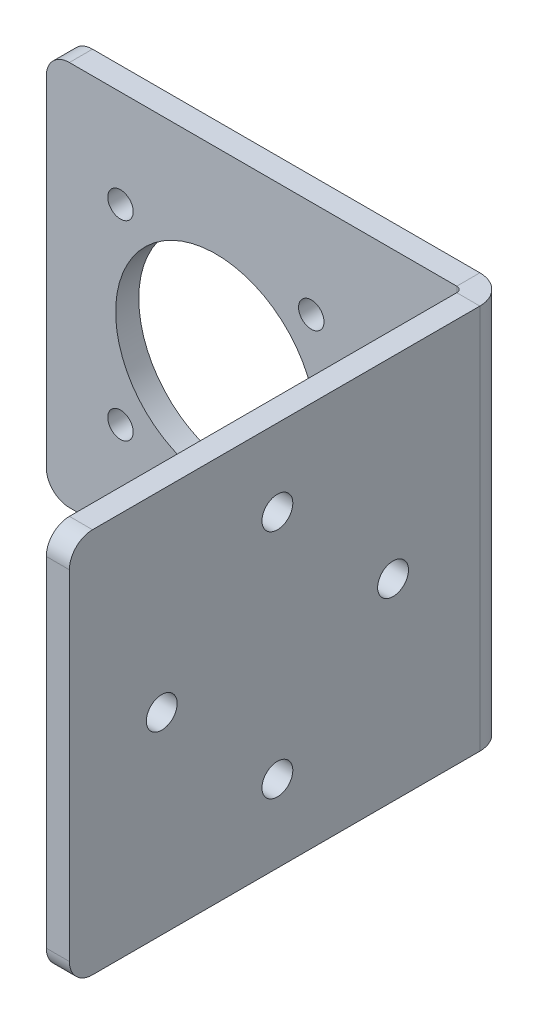
ISO-10303-21;
HEADER;
FILE_DESCRIPTION(('STEP AP214'),'2;1');
FILE_NAME('part.step','',(''),(''),'','','');
FILE_SCHEMA(('AUTOMOTIVE_DESIGN { 1 0 10303 214 1 1 1 1 }'));
ENDSEC;
DATA;
#1=APPLICATION_CONTEXT('core data for automotive mechanical design processes');
#2=APPLICATION_PROTOCOL_DEFINITION('international standard','automotive_design',2000,#1);
#3=PRODUCT_CONTEXT('',#1,'mechanical');
#4=PRODUCT('Part','Part','',(#3));
#5=PRODUCT_RELATED_PRODUCT_CATEGORY('part','',(#4));
#6=PRODUCT_DEFINITION_FORMATION('','',#4);
#7=PRODUCT_DEFINITION_CONTEXT('part definition',#1,'design');
#8=PRODUCT_DEFINITION('design','',#6,#7);
#9=PRODUCT_DEFINITION_SHAPE('','',#8);
#10=(LENGTH_UNIT() NAMED_UNIT(*) SI_UNIT(.MILLI.,.METRE.));
#11=(NAMED_UNIT(*) PLANE_ANGLE_UNIT() SI_UNIT($,.RADIAN.));
#12=(NAMED_UNIT(*) SI_UNIT($,.STERADIAN.) SOLID_ANGLE_UNIT());
#13=UNCERTAINTY_MEASURE_WITH_UNIT(LENGTH_MEASURE(1.E-05),#10,'distance_accuracy_value','');
#14=(GEOMETRIC_REPRESENTATION_CONTEXT(3) GLOBAL_UNCERTAINTY_ASSIGNED_CONTEXT((#13)) GLOBAL_UNIT_ASSIGNED_CONTEXT((#10,
#11,#12)) REPRESENTATION_CONTEXT('',''));
#15=CARTESIAN_POINT('',(0.,0.,0.));
#16=DIRECTION('',(0.,0.,1.));
#17=DIRECTION('',(1.,0.,0.));
#18=AXIS2_PLACEMENT_3D('',#15,#16,#17);
#19=CARTESIAN_POINT('',(-1.02002153225473,0.,-1.02002153225474));
#20=DIRECTION('',(1.,0.,0.));
#21=DIRECTION('',(0.,0.,-1.));
#22=AXIS2_PLACEMENT_3D('',#19,#20,#21);
#23=PLANE('',#22);
#24=CARTESIAN_POINT('',(-1.02002153225477,0.,12.0000000000002));
#25=DIRECTION('',(-1.,0.,0.));
#26=DIRECTION('',(0.,0.,1.));
#27=AXIS2_PLACEMENT_3D('',#24,#25,#26);
#28=CIRCLE('',#27,2.);
#29=CARTESIAN_POINT('',(-1.02002153225478,0.,14.0000000000002));
#30=VERTEX_POINT('',#29);
#31=EDGE_CURVE('E200',#30,#30,#28,.T.);
#32=ORIENTED_EDGE('',*,*,#31,.F.);
#33=EDGE_LOOP('',(#32));
#34=FACE_BOUND('',#33,.T.);
#35=CARTESIAN_POINT('',(-1.02002153225488,0.,42.0000000000002));
#36=DIRECTION('',(-1.,0.,0.));
#37=DIRECTION('',(0.,0.,1.));
#38=AXIS2_PLACEMENT_3D('',#35,#36,#37);
#39=CIRCLE('',#38,2.);
#40=CARTESIAN_POINT('',(-1.02002153225488,0.,44.0000000000002));
#41=VERTEX_POINT('',#40);
#42=EDGE_CURVE('E276',#41,#41,#39,.T.);
#43=ORIENTED_EDGE('',*,*,#42,.F.);
#44=EDGE_LOOP('',(#43));
#45=FACE_BOUND('',#44,.T.);
#46=CARTESIAN_POINT('',(-1.02002153225483,15.,27.0000000000002));
#47=DIRECTION('',(-1.,0.,0.));
#48=DIRECTION('',(0.,0.,1.));
#49=AXIS2_PLACEMENT_3D('',#46,#47,#48);
#50=CIRCLE('',#49,2.);
#51=CARTESIAN_POINT('',(-1.02002153225483,15.,29.0000000000002));
#52=VERTEX_POINT('',#51);
#53=EDGE_CURVE('E272',#52,#52,#50,.T.);
#54=ORIENTED_EDGE('',*,*,#53,.F.);
#55=EDGE_LOOP('',(#54));
#56=FACE_BOUND('',#55,.T.);
#57=CARTESIAN_POINT('',(-1.02002153225483,-15.,27.0000000000002));
#58=DIRECTION('',(-1.,0.,0.));
#59=DIRECTION('',(0.,0.,1.));
#60=AXIS2_PLACEMENT_3D('',#57,#58,#59);
#61=CIRCLE('',#60,2.);
#62=CARTESIAN_POINT('',(-1.02002153225483,-15.,29.0000000000002));
#63=VERTEX_POINT('',#62);
#64=EDGE_CURVE('E269',#63,#63,#61,.T.);
#65=ORIENTED_EDGE('',*,*,#64,.F.);
#66=EDGE_LOOP('',(#65));
#67=FACE_BOUND('',#66,.T.);
#68=DIRECTION('',(0.,0.,1.));
#69=VECTOR('',#68,1.);
#70=CARTESIAN_POINT('',(-1.02002153225454,-25.,-56.0200215322547));
#71=LINE('',#70,#69);
#72=CARTESIAN_POINT('',(-1.02002153225473,-25.,0.736600000000003));
#73=VERTEX_POINT('',#72);
#74=CARTESIAN_POINT('',(-1.02002153225491,-25.,50.9799784677453));
#75=VERTEX_POINT('',#74);
#76=EDGE_CURVE('E174',#73,#75,#71,.T.);
#77=ORIENTED_EDGE('',*,*,#76,.T.);
#78=CARTESIAN_POINT('',(-1.02002153225491,-22.,50.9799784677453));
#79=DIRECTION('',(1.,0.,0.));
#80=DIRECTION('',(0.,0.,-1.));
#81=AXIS2_PLACEMENT_3D('',#78,#79,#80);
#82=CIRCLE('',#81,3.);
#83=CARTESIAN_POINT('',(-1.02002153225492,-22.,53.9799784677453));
#84=VERTEX_POINT('',#83);
#85=EDGE_CURVE('E214',#75,#84,#82,.F.);
#86=ORIENTED_EDGE('',*,*,#85,.T.);
#87=DIRECTION('',(0.,1.,0.));
#88=VECTOR('',#87,1.);
#89=CARTESIAN_POINT('',(-1.02002153225492,-25.,53.9799784677453));
#90=LINE('',#89,#88);
#91=CARTESIAN_POINT('',(-1.02002153225492,22.,53.9799784677453));
#92=VERTEX_POINT('',#91);
#93=EDGE_CURVE('E175',#84,#92,#90,.T.);
#94=ORIENTED_EDGE('',*,*,#93,.T.);
#95=CARTESIAN_POINT('',(-1.02002153225491,22.,50.9799784677453));
#96=DIRECTION('',(1.,0.,0.));
#97=DIRECTION('',(0.,0.,-1.));
#98=AXIS2_PLACEMENT_3D('',#95,#96,#97);
#99=CIRCLE('',#98,3.);
#100=CARTESIAN_POINT('',(-1.02002153225491,25.,50.9799784677453));
#101=VERTEX_POINT('',#100);
#102=EDGE_CURVE('E212',#92,#101,#99,.F.);
#103=ORIENTED_EDGE('',*,*,#102,.T.);
#104=DIRECTION('',(0.,0.,-1.));
#105=VECTOR('',#104,1.);
#106=CARTESIAN_POINT('',(-1.02002153225454,25.,-56.0200215322547));
#107=LINE('',#106,#105);
#108=CARTESIAN_POINT('',(-1.02002153225473,25.,0.736600000000003));
#109=VERTEX_POINT('',#108);
#110=EDGE_CURVE('E178',#101,#109,#107,.T.);
#111=ORIENTED_EDGE('',*,*,#110,.T.);
#112=DIRECTION('',(0.,-1.,0.));
#113=VECTOR('',#112,1.);
#114=CARTESIAN_POINT('',(-1.02002153225473,0.,0.7366));
#115=LINE('',#114,#113);
#116=EDGE_CURVE('E183',#109,#73,#115,.T.);
#117=ORIENTED_EDGE('',*,*,#116,.T.);
#118=EDGE_LOOP('',(#77,#86,#94,#103,#111,#117));
#119=FACE_BOUND('',#118,.T.);
#120=ADVANCED_FACE('F44',(#34,#45,#56,#67,#119),#23,.F.);
#121=CARTESIAN_POINT('',(1.97997846774508,-25.,53.9799784677453));
#122=DIRECTION('',(0.,0.,1.));
#123=DIRECTION('',(1.,0.,0.));
#124=AXIS2_PLACEMENT_3D('',#121,#122,#123);
#125=PLANE('',#124);
#126=ORIENTED_EDGE('',*,*,#93,.F.);
#127=DIRECTION('',(-1.,0.,0.));
#128=VECTOR('',#127,1.);
#129=CARTESIAN_POINT('',(1.97997846774508,-22.,53.9799784677453));
#130=LINE('',#129,#128);
#131=CARTESIAN_POINT('',(1.97997846774508,-22.,53.9799784677453));
#132=VERTEX_POINT('',#131);
#133=EDGE_CURVE('E219',#84,#132,#130,.F.);
#134=ORIENTED_EDGE('',*,*,#133,.T.);
#135=DIRECTION('',(0.,1.,0.));
#136=VECTOR('',#135,1.);
#137=CARTESIAN_POINT('',(1.97997846774508,-25.,53.9799784677453));
#138=LINE('',#137,#136);
#139=CARTESIAN_POINT('',(1.97997846774508,22.,53.9799784677453));
#140=VERTEX_POINT('',#139);
#141=EDGE_CURVE('E170',#132,#140,#138,.T.);
#142=ORIENTED_EDGE('',*,*,#141,.T.);
#143=DIRECTION('',(-1.,0.,0.));
#144=VECTOR('',#143,1.);
#145=CARTESIAN_POINT('',(1.97997846774508,22.,53.9799784677453));
#146=LINE('',#145,#144);
#147=EDGE_CURVE('E216',#140,#92,#146,.T.);
#148=ORIENTED_EDGE('',*,*,#147,.T.);
#149=EDGE_LOOP('',(#126,#134,#142,#148));
#150=FACE_BOUND('',#149,.T.);
#151=ADVANCED_FACE('F335',(#150),#125,.T.);
#152=CARTESIAN_POINT('',(1.97997846774546,-25.,-56.0200215322547));
#153=DIRECTION('',(0.,-1.,0.));
#154=DIRECTION('',(1.,0.,0.));
#155=AXIS2_PLACEMENT_3D('',#152,#153,#154);
#156=PLANE('',#155);
#157=DIRECTION('',(0.,0.,1.));
#158=VECTOR('',#157,1.);
#159=CARTESIAN_POINT('',(1.97997846774546,-25.,-56.0200215322547));
#160=LINE('',#159,#158);
#161=CARTESIAN_POINT('',(1.97997846774526,-25.,0.736600000000023));
#162=VERTEX_POINT('',#161);
#163=CARTESIAN_POINT('',(1.97997846774509,-25.,50.9799784677453));
#164=VERTEX_POINT('',#163);
#165=EDGE_CURVE('E181',#162,#164,#160,.T.);
#166=ORIENTED_EDGE('',*,*,#165,.T.);
#167=DIRECTION('',(-1.,0.,0.));
#168=VECTOR('',#167,1.);
#169=CARTESIAN_POINT('',(1.97997846774509,-25.,50.9799784677453));
#170=LINE('',#169,#168);
#171=EDGE_CURVE('E189',#164,#75,#170,.T.);
#172=ORIENTED_EDGE('',*,*,#171,.T.);
#173=ORIENTED_EDGE('',*,*,#76,.F.);
#174=DIRECTION('',(-1.,0.,0.));
#175=VECTOR('',#174,1.);
#176=CARTESIAN_POINT('',(1.97997846774527,-25.,0.736600000000013));
#177=LINE('',#176,#175);
#178=EDGE_CURVE('E180',#162,#73,#177,.T.);
#179=ORIENTED_EDGE('',*,*,#178,.F.);
#180=EDGE_LOOP('',(#166,#172,#173,#179));
#181=FACE_BOUND('',#180,.T.);
#182=ADVANCED_FACE('F341',(#181),#156,.T.);
#183=CARTESIAN_POINT('',(1.97997846774546,25.,-56.0200215322547));
#184=DIRECTION('',(0.,1.,0.));
#185=DIRECTION('',(-1.,0.,0.));
#186=AXIS2_PLACEMENT_3D('',#183,#184,#185);
#187=PLANE('',#186);
#188=ORIENTED_EDGE('',*,*,#110,.F.);
#189=DIRECTION('',(-1.,0.,0.));
#190=VECTOR('',#189,1.);
#191=CARTESIAN_POINT('',(1.97997846774509,25.,50.9799784677453));
#192=LINE('',#191,#190);
#193=CARTESIAN_POINT('',(1.97997846774509,25.,50.9799784677453));
#194=VERTEX_POINT('',#193);
#195=EDGE_CURVE('E225',#101,#194,#192,.F.);
#196=ORIENTED_EDGE('',*,*,#195,.T.);
#197=DIRECTION('',(0.,0.,-1.));
#198=VECTOR('',#197,1.);
#199=CARTESIAN_POINT('',(1.97997846774546,25.,-56.0200215322547));
#200=LINE('',#199,#198);
#201=CARTESIAN_POINT('',(1.97997846774527,25.,0.736600000000013));
#202=VERTEX_POINT('',#201);
#203=EDGE_CURVE('E173',#194,#202,#200,.T.);
#204=ORIENTED_EDGE('',*,*,#203,.T.);
#205=DIRECTION('',(1.,0.,0.));
#206=VECTOR('',#205,1.);
#207=CARTESIAN_POINT('',(1.97997846774527,25.,0.736600000000013));
#208=LINE('',#207,#206);
#209=EDGE_CURVE('E186',#109,#202,#208,.T.);
#210=ORIENTED_EDGE('',*,*,#209,.F.);
#211=EDGE_LOOP('',(#188,#196,#204,#210));
#212=FACE_BOUND('',#211,.T.);
#213=ADVANCED_FACE('F349',(#212),#187,.T.);
#214=CARTESIAN_POINT('',(1.97997846774527,0.,-1.02002153225473));
#215=DIRECTION('',(1.,0.,0.));
#216=DIRECTION('',(0.,0.,-1.));
#217=AXIS2_PLACEMENT_3D('',#214,#215,#216);
#218=PLANE('',#217);
#219=CARTESIAN_POINT('',(1.97997846774523,0.,12.0000000000002));
#220=DIRECTION('',(1.,0.,0.));
#221=DIRECTION('',(0.,0.,-1.));
#222=AXIS2_PLACEMENT_3D('',#219,#220,#221);
#223=CIRCLE('',#222,2.);
#224=CARTESIAN_POINT('',(1.97997846774523,0.,10.0000000000002));
#225=VERTEX_POINT('',#224);
#226=EDGE_CURVE('E206',#225,#225,#223,.T.);
#227=ORIENTED_EDGE('',*,*,#226,.F.);
#228=EDGE_LOOP('',(#227));
#229=FACE_BOUND('',#228,.T.);
#230=CARTESIAN_POINT('',(1.97997846774512,0.,42.0000000000002));
#231=DIRECTION('',(1.,0.,0.));
#232=DIRECTION('',(0.,0.,-1.));
#233=AXIS2_PLACEMENT_3D('',#230,#231,#232);
#234=CIRCLE('',#233,2.);
#235=CARTESIAN_POINT('',(1.97997846774513,0.,40.0000000000002));
#236=VERTEX_POINT('',#235);
#237=EDGE_CURVE('E203',#236,#236,#234,.T.);
#238=ORIENTED_EDGE('',*,*,#237,.F.);
#239=EDGE_LOOP('',(#238));
#240=FACE_BOUND('',#239,.T.);
#241=CARTESIAN_POINT('',(1.97997846774517,15.,27.0000000000002));
#242=DIRECTION('',(1.,0.,0.));
#243=DIRECTION('',(0.,0.,-1.));
#244=AXIS2_PLACEMENT_3D('',#241,#242,#243);
#245=CIRCLE('',#244,2.);
#246=CARTESIAN_POINT('',(1.97997846774518,15.,25.0000000000002));
#247=VERTEX_POINT('',#246);
#248=EDGE_CURVE('E199',#247,#247,#245,.T.);
#249=ORIENTED_EDGE('',*,*,#248,.F.);
#250=EDGE_LOOP('',(#249));
#251=FACE_BOUND('',#250,.T.);
#252=CARTESIAN_POINT('',(1.97997846774517,-15.,27.0000000000002));
#253=DIRECTION('',(1.,0.,0.));
#254=DIRECTION('',(0.,0.,-1.));
#255=AXIS2_PLACEMENT_3D('',#252,#253,#254);
#256=CIRCLE('',#255,2.);
#257=CARTESIAN_POINT('',(1.97997846774518,-15.,25.0000000000002));
#258=VERTEX_POINT('',#257);
#259=EDGE_CURVE('E196',#258,#258,#256,.T.);
#260=ORIENTED_EDGE('',*,*,#259,.F.);
#261=EDGE_LOOP('',(#260));
#262=FACE_BOUND('',#261,.T.);
#263=ORIENTED_EDGE('',*,*,#141,.F.);
#264=CARTESIAN_POINT('',(1.97997846774509,-22.,50.9799784677453));
#265=DIRECTION('',(1.,0.,0.));
#266=DIRECTION('',(0.,0.,-1.));
#267=AXIS2_PLACEMENT_3D('',#264,#265,#266);
#268=CIRCLE('',#267,3.);
#269=EDGE_CURVE('E223',#132,#164,#268,.T.);
#270=ORIENTED_EDGE('',*,*,#269,.T.);
#271=ORIENTED_EDGE('',*,*,#165,.F.);
#272=DIRECTION('',(0.,-1.,0.));
#273=VECTOR('',#272,1.);
#274=CARTESIAN_POINT('',(1.97997846774527,0.,0.73660000000001));
#275=LINE('',#274,#273);
#276=EDGE_CURVE('E156',#202,#162,#275,.T.);
#277=ORIENTED_EDGE('',*,*,#276,.F.);
#278=ORIENTED_EDGE('',*,*,#203,.F.);
#279=CARTESIAN_POINT('',(1.97997846774509,22.,50.9799784677453));
#280=DIRECTION('',(1.,0.,0.));
#281=DIRECTION('',(0.,0.,-1.));
#282=AXIS2_PLACEMENT_3D('',#279,#280,#281);
#283=CIRCLE('',#282,3.);
#284=EDGE_CURVE('E221',#194,#140,#283,.T.);
#285=ORIENTED_EDGE('',*,*,#284,.T.);
#286=EDGE_LOOP('',(#263,#270,#271,#277,#278,#285));
#287=FACE_BOUND('',#286,.T.);
#288=ADVANCED_FACE('F352',(#229,#240,#251,#262,#287),#218,.T.);
#289=CARTESIAN_POINT('',(-55.,-25.,-3.));
#290=DIRECTION('',(-1.,0.,0.));
#291=DIRECTION('',(0.,0.,1.));
#292=AXIS2_PLACEMENT_3D('',#289,#290,#291);
#293=PLANE('',#292);
#294=DIRECTION('',(0.,-1.,0.));
#295=VECTOR('',#294,1.);
#296=CARTESIAN_POINT('',(-55.,-25.,0.));
#297=LINE('',#296,#295);
#298=CARTESIAN_POINT('',(-55.,22.,0.));
#299=VERTEX_POINT('',#298);
#300=CARTESIAN_POINT('',(-55.,-22.,0.));
#301=VERTEX_POINT('',#300);
#302=EDGE_CURVE('E254',#299,#301,#297,.T.);
#303=ORIENTED_EDGE('',*,*,#302,.F.);
#304=DIRECTION('',(0.,0.,1.));
#305=VECTOR('',#304,1.);
#306=CARTESIAN_POINT('',(-55.,22.,-3.));
#307=LINE('',#306,#305);
#308=CARTESIAN_POINT('',(-55.,22.,-3.));
#309=VERTEX_POINT('',#308);
#310=EDGE_CURVE('E237',#299,#309,#307,.F.);
#311=ORIENTED_EDGE('',*,*,#310,.T.);
#312=DIRECTION('',(0.,-1.,0.));
#313=VECTOR('',#312,1.);
#314=CARTESIAN_POINT('',(-55.,-25.,-3.));
#315=LINE('',#314,#313);
#316=CARTESIAN_POINT('',(-55.,-22.,-3.));
#317=VERTEX_POINT('',#316);
#318=EDGE_CURVE('E165',#309,#317,#315,.T.);
#319=ORIENTED_EDGE('',*,*,#318,.T.);
#320=DIRECTION('',(0.,0.,1.));
#321=VECTOR('',#320,1.);
#322=CARTESIAN_POINT('',(-55.,-22.,-3.));
#323=LINE('',#322,#321);
#324=EDGE_CURVE('E234',#317,#301,#323,.T.);
#325=ORIENTED_EDGE('',*,*,#324,.T.);
#326=EDGE_LOOP('',(#303,#311,#319,#325));
#327=FACE_BOUND('',#326,.T.);
#328=ADVANCED_FACE('F257',(#327),#293,.T.);
#329=CARTESIAN_POINT('',(0.,0.,-3.));
#330=DIRECTION('',(0.,0.,-1.));
#331=DIRECTION('',(-1.,0.,0.));
#332=AXIS2_PLACEMENT_3D('',#329,#330,#331);
#333=PLANE('',#332);
#334=CARTESIAN_POINT('',(-45.3743686707647,12.3743686707645,-3.));
#335=DIRECTION('',(0.,0.,1.));
#336=DIRECTION('',(1.,0.,0.));
#337=AXIS2_PLACEMENT_3D('',#334,#335,#336);
#338=CIRCLE('',#337,1.65);
#339=CARTESIAN_POINT('',(-43.7243686707646,12.3743686707645,-3.));
#340=VERTEX_POINT('',#339);
#341=EDGE_CURVE('E293',#340,#340,#338,.T.);
#342=ORIENTED_EDGE('',*,*,#341,.T.);
#343=EDGE_LOOP('',(#342));
#344=FACE_BOUND('',#343,.T.);
#345=CARTESIAN_POINT('',(-45.374368670764,-12.3743686707645,-3.));
#346=DIRECTION('',(0.,0.,1.));
#347=DIRECTION('',(1.,0.,0.));
#348=AXIS2_PLACEMENT_3D('',#345,#346,#347);
#349=CIRCLE('',#348,1.65);
#350=CARTESIAN_POINT('',(-43.724368670764,-12.3743686707645,-3.));
#351=VERTEX_POINT('',#350);
#352=EDGE_CURVE('E299',#351,#351,#349,.T.);
#353=ORIENTED_EDGE('',*,*,#352,.T.);
#354=EDGE_LOOP('',(#353));
#355=FACE_BOUND('',#354,.T.);
#356=CARTESIAN_POINT('',(-20.6256313292348,-12.3743686707639,-3.));
#357=DIRECTION('',(0.,0.,1.));
#358=DIRECTION('',(1.,0.,0.));
#359=AXIS2_PLACEMENT_3D('',#356,#357,#358);
#360=CIRCLE('',#359,1.65000000000001);
#361=CARTESIAN_POINT('',(-18.9756313292348,-12.3743686707639,-3.));
#362=VERTEX_POINT('',#361);
#363=EDGE_CURVE('E305',#362,#362,#360,.T.);
#364=ORIENTED_EDGE('',*,*,#363,.T.);
#365=EDGE_LOOP('',(#364));
#366=FACE_BOUND('',#365,.T.);
#367=CARTESIAN_POINT('',(-20.6256313292354,12.3743686707653,-3.));
#368=DIRECTION('',(0.,0.,1.));
#369=DIRECTION('',(1.,0.,0.));
#370=AXIS2_PLACEMENT_3D('',#367,#368,#369);
#371=CIRCLE('',#370,1.65);
#372=CARTESIAN_POINT('',(-18.9756313292354,12.3743686707653,-3.));
#373=VERTEX_POINT('',#372);
#374=EDGE_CURVE('E286',#373,#373,#371,.T.);
#375=ORIENTED_EDGE('',*,*,#374,.T.);
#376=EDGE_LOOP('',(#375));
#377=FACE_BOUND('',#376,.T.);
#378=CARTESIAN_POINT('',(-33.,0.,-3.));
#379=DIRECTION('',(0.,0.,-1.));
#380=DIRECTION('',(-1.,0.,0.));
#381=AXIS2_PLACEMENT_3D('',#378,#379,#380);
#382=CIRCLE('',#381,13.);
#383=CARTESIAN_POINT('',(-46.,0.,-3.));
#384=VERTEX_POINT('',#383);
#385=EDGE_CURVE('E273',#384,#384,#382,.T.);
#386=ORIENTED_EDGE('',*,*,#385,.F.);
#387=EDGE_LOOP('',(#386));
#388=FACE_BOUND('',#387,.T.);
#389=ORIENTED_EDGE('',*,*,#318,.F.);
#390=CARTESIAN_POINT('',(-52.,22.,-3.));
#391=DIRECTION('',(0.,0.,-1.));
#392=DIRECTION('',(-1.,0.,0.));
#393=AXIS2_PLACEMENT_3D('',#390,#391,#392);
#394=CIRCLE('',#393,3.);
#395=CARTESIAN_POINT('',(-52.,25.,-3.));
#396=VERTEX_POINT('',#395);
#397=EDGE_CURVE('E52',#309,#396,#394,.T.);
#398=ORIENTED_EDGE('',*,*,#397,.T.);
#399=DIRECTION('',(-1.,0.,0.));
#400=VECTOR('',#399,1.);
#401=CARTESIAN_POINT('',(-55.,25.,-3.));
#402=LINE('',#401,#400);
#403=CARTESIAN_POINT('',(-1.75662153225474,25.,-3.));
#404=VERTEX_POINT('',#403);
#405=EDGE_CURVE('E163',#404,#396,#402,.T.);
#406=ORIENTED_EDGE('',*,*,#405,.F.);
#407=DIRECTION('',(0.,-1.,0.));
#408=VECTOR('',#407,1.);
#409=CARTESIAN_POINT('',(-1.75662153225474,0.,-3.));
#410=LINE('',#409,#408);
#411=CARTESIAN_POINT('',(-1.75662153225474,-25.,-3.));
#412=VERTEX_POINT('',#411);
#413=EDGE_CURVE('E136',#404,#412,#410,.T.);
#414=ORIENTED_EDGE('',*,*,#413,.T.);
#415=DIRECTION('',(1.,0.,0.));
#416=VECTOR('',#415,1.);
#417=CARTESIAN_POINT('',(-55.,-25.,-3.));
#418=LINE('',#417,#416);
#419=CARTESIAN_POINT('',(-52.,-25.,-3.));
#420=VERTEX_POINT('',#419);
#421=EDGE_CURVE('E131',#420,#412,#418,.T.);
#422=ORIENTED_EDGE('',*,*,#421,.F.);
#423=CARTESIAN_POINT('',(-52.,-22.,-3.));
#424=DIRECTION('',(0.,0.,-1.));
#425=DIRECTION('',(-1.,0.,0.));
#426=AXIS2_PLACEMENT_3D('',#423,#424,#425);
#427=CIRCLE('',#426,3.);
#428=EDGE_CURVE('E64',#420,#317,#427,.T.);
#429=ORIENTED_EDGE('',*,*,#428,.T.);
#430=EDGE_LOOP('',(#389,#398,#406,#414,#422,#429));
#431=FACE_BOUND('',#430,.T.);
#432=ADVANCED_FACE('F161',(#344,#355,#366,#377,#388,#431),#333,.T.);
#433=CARTESIAN_POINT('',(-55.,-25.,-3.));
#434=DIRECTION('',(0.,-1.,0.));
#435=DIRECTION('',(0.,0.,-1.));
#436=AXIS2_PLACEMENT_3D('',#433,#434,#435);
#437=PLANE('',#436);
#438=DIRECTION('',(1.,0.,0.));
#439=VECTOR('',#438,1.);
#440=CARTESIAN_POINT('',(-55.,-25.,0.));
#441=LINE('',#440,#439);
#442=CARTESIAN_POINT('',(-52.,-25.,0.));
#443=VERTEX_POINT('',#442);
#444=CARTESIAN_POINT('',(-1.75662153225474,-25.,0.));
#445=VERTEX_POINT('',#444);
#446=EDGE_CURVE('E259',#443,#445,#441,.T.);
#447=ORIENTED_EDGE('',*,*,#446,.F.);
#448=DIRECTION('',(0.,0.,1.));
#449=VECTOR('',#448,1.);
#450=CARTESIAN_POINT('',(-52.,-25.,-3.));
#451=LINE('',#450,#449);
#452=EDGE_CURVE('E12',#443,#420,#451,.F.);
#453=ORIENTED_EDGE('',*,*,#452,.T.);
#454=ORIENTED_EDGE('',*,*,#421,.T.);
#455=DIRECTION('',(0.,0.,1.));
#456=VECTOR('',#455,1.);
#457=CARTESIAN_POINT('',(-1.75662153225474,-25.,-3.));
#458=LINE('',#457,#456);
#459=EDGE_CURVE('E134',#412,#445,#458,.T.);
#460=ORIENTED_EDGE('',*,*,#459,.T.);
#461=EDGE_LOOP('',(#447,#453,#454,#460));
#462=FACE_BOUND('',#461,.T.);
#463=ADVANCED_FACE('F133',(#462),#437,.T.);
#464=CARTESIAN_POINT('',(0.,0.,0.));
#465=DIRECTION('',(0.,0.,-1.));
#466=DIRECTION('',(-1.,0.,0.));
#467=AXIS2_PLACEMENT_3D('',#464,#465,#466);
#468=PLANE('',#467);
#469=CARTESIAN_POINT('',(-45.3743686707647,12.3743686707645,0.));
#470=DIRECTION('',(0.,0.,1.));
#471=DIRECTION('',(1.,0.,0.));
#472=AXIS2_PLACEMENT_3D('',#469,#470,#471);
#473=CIRCLE('',#472,1.65);
#474=CARTESIAN_POINT('',(-43.7243686707646,12.3743686707645,0.));
#475=VERTEX_POINT('',#474);
#476=EDGE_CURVE('E296',#475,#475,#473,.T.);
#477=ORIENTED_EDGE('',*,*,#476,.F.);
#478=EDGE_LOOP('',(#477));
#479=FACE_BOUND('',#478,.T.);
#480=CARTESIAN_POINT('',(-45.374368670764,-12.3743686707645,0.));
#481=DIRECTION('',(0.,0.,1.));
#482=DIRECTION('',(1.,0.,0.));
#483=AXIS2_PLACEMENT_3D('',#480,#481,#482);
#484=CIRCLE('',#483,1.65);
#485=CARTESIAN_POINT('',(-43.724368670764,-12.3743686707645,0.));
#486=VERTEX_POINT('',#485);
#487=EDGE_CURVE('E302',#486,#486,#484,.T.);
#488=ORIENTED_EDGE('',*,*,#487,.F.);
#489=EDGE_LOOP('',(#488));
#490=FACE_BOUND('',#489,.T.);
#491=CARTESIAN_POINT('',(-20.6256313292348,-12.3743686707639,0.));
#492=DIRECTION('',(0.,0.,1.));
#493=DIRECTION('',(1.,0.,0.));
#494=AXIS2_PLACEMENT_3D('',#491,#492,#493);
#495=CIRCLE('',#494,1.65000000000001);
#496=CARTESIAN_POINT('',(-18.9756313292348,-12.3743686707639,0.));
#497=VERTEX_POINT('',#496);
#498=EDGE_CURVE('E290',#497,#497,#495,.T.);
#499=ORIENTED_EDGE('',*,*,#498,.F.);
#500=EDGE_LOOP('',(#499));
#501=FACE_BOUND('',#500,.T.);
#502=CARTESIAN_POINT('',(-20.6256313292354,12.3743686707653,0.));
#503=DIRECTION('',(0.,0.,1.));
#504=DIRECTION('',(1.,0.,0.));
#505=AXIS2_PLACEMENT_3D('',#502,#503,#504);
#506=CIRCLE('',#505,1.65);
#507=CARTESIAN_POINT('',(-18.9756313292354,12.3743686707653,0.));
#508=VERTEX_POINT('',#507);
#509=EDGE_CURVE('E287',#508,#508,#506,.T.);
#510=ORIENTED_EDGE('',*,*,#509,.F.);
#511=EDGE_LOOP('',(#510));
#512=FACE_BOUND('',#511,.T.);
#513=CARTESIAN_POINT('',(-33.,0.,0.));
#514=DIRECTION('',(0.,0.,1.));
#515=DIRECTION('',(1.,0.,0.));
#516=AXIS2_PLACEMENT_3D('',#513,#514,#515);
#517=CIRCLE('',#516,13.);
#518=CARTESIAN_POINT('',(-20.,0.,0.));
#519=VERTEX_POINT('',#518);
#520=EDGE_CURVE('E283',#519,#519,#517,.T.);
#521=ORIENTED_EDGE('',*,*,#520,.F.);
#522=EDGE_LOOP('',(#521));
#523=FACE_BOUND('',#522,.T.);
#524=DIRECTION('',(-1.,0.,0.));
#525=VECTOR('',#524,1.);
#526=CARTESIAN_POINT('',(-55.,25.,0.));
#527=LINE('',#526,#525);
#528=CARTESIAN_POINT('',(-1.75662153225474,25.,0.));
#529=VERTEX_POINT('',#528);
#530=CARTESIAN_POINT('',(-52.,25.,0.));
#531=VERTEX_POINT('',#530);
#532=EDGE_CURVE('E148',#529,#531,#527,.T.);
#533=ORIENTED_EDGE('',*,*,#532,.T.);
#534=CARTESIAN_POINT('',(-52.,22.,0.));
#535=DIRECTION('',(0.,0.,-1.));
#536=DIRECTION('',(-1.,0.,0.));
#537=AXIS2_PLACEMENT_3D('',#534,#535,#536);
#538=CIRCLE('',#537,3.);
#539=EDGE_CURVE('E232',#531,#299,#538,.F.);
#540=ORIENTED_EDGE('',*,*,#539,.T.);
#541=ORIENTED_EDGE('',*,*,#302,.T.);
#542=CARTESIAN_POINT('',(-52.,-22.,0.));
#543=DIRECTION('',(0.,0.,-1.));
#544=DIRECTION('',(-1.,0.,0.));
#545=AXIS2_PLACEMENT_3D('',#542,#543,#544);
#546=CIRCLE('',#545,3.);
#547=EDGE_CURVE('E230',#301,#443,#546,.F.);
#548=ORIENTED_EDGE('',*,*,#547,.T.);
#549=ORIENTED_EDGE('',*,*,#446,.T.);
#550=DIRECTION('',(0.,-1.,0.));
#551=VECTOR('',#550,1.);
#552=CARTESIAN_POINT('',(-1.75662153225474,0.,0.));
#553=LINE('',#552,#551);
#554=EDGE_CURVE('E157',#529,#445,#553,.T.);
#555=ORIENTED_EDGE('',*,*,#554,.F.);
#556=EDGE_LOOP('',(#533,#540,#541,#548,#549,#555));
#557=FACE_BOUND('',#556,.T.);
#558=ADVANCED_FACE('F253',(#479,#490,#501,#512,#523,#557),#468,.F.);
#559=CARTESIAN_POINT('',(-55.,25.,-3.));
#560=DIRECTION('',(0.,1.,0.));
#561=DIRECTION('',(0.,0.,1.));
#562=AXIS2_PLACEMENT_3D('',#559,#560,#561);
#563=PLANE('',#562);
#564=ORIENTED_EDGE('',*,*,#405,.T.);
#565=DIRECTION('',(0.,0.,1.));
#566=VECTOR('',#565,1.);
#567=CARTESIAN_POINT('',(-52.,25.,-3.));
#568=LINE('',#567,#566);
#569=EDGE_CURVE('E227',#396,#531,#568,.T.);
#570=ORIENTED_EDGE('',*,*,#569,.T.);
#571=ORIENTED_EDGE('',*,*,#532,.F.);
#572=DIRECTION('',(0.,0.,-1.));
#573=VECTOR('',#572,1.);
#574=CARTESIAN_POINT('',(-1.75662153225474,25.,-3.));
#575=LINE('',#574,#573);
#576=EDGE_CURVE('E247',#529,#404,#575,.T.);
#577=ORIENTED_EDGE('',*,*,#576,.T.);
#578=EDGE_LOOP('',(#564,#570,#571,#577));
#579=FACE_BOUND('',#578,.T.);
#580=ADVANCED_FACE('F244',(#579),#563,.T.);
#581=CARTESIAN_POINT('',(-1.75662153225474,25.,0.7366));
#582=DIRECTION('',(0.,1.,0.));
#583=DIRECTION('',(0.,0.,1.));
#584=AXIS2_PLACEMENT_3D('',#581,#582,#583);
#585=PLANE('',#584);
#586=ORIENTED_EDGE('',*,*,#576,.F.);
#587=CARTESIAN_POINT('',(-1.75662153225474,25.,0.7366));
#588=DIRECTION('',(0.,-1.,0.));
#589=DIRECTION('',(0.,0.,-1.));
#590=AXIS2_PLACEMENT_3D('',#587,#588,#589);
#591=CIRCLE('',#590,0.7366);
#592=EDGE_CURVE('E209',#529,#109,#591,.T.);
#593=ORIENTED_EDGE('',*,*,#592,.T.);
#594=ORIENTED_EDGE('',*,*,#209,.T.);
#595=CARTESIAN_POINT('',(-1.75662153225474,25.,0.7366));
#596=DIRECTION('',(0.,-1.,0.));
#597=DIRECTION('',(0.,0.,1.));
#598=AXIS2_PLACEMENT_3D('',#595,#596,#597);
#599=CIRCLE('',#598,3.7366);
#600=EDGE_CURVE('E158',#404,#202,#599,.T.);
#601=ORIENTED_EDGE('',*,*,#600,.F.);
#602=EDGE_LOOP('',(#586,#593,#594,#601));
#603=FACE_BOUND('',#602,.T.);
#604=ADVANCED_FACE('F500',(#603),#585,.T.);
#605=CARTESIAN_POINT('',(-1.75662153225474,-25.,0.7366));
#606=DIRECTION('',(0.,-1.,0.));
#607=DIRECTION('',(0.,0.,-1.));
#608=AXIS2_PLACEMENT_3D('',#605,#606,#607);
#609=PLANE('',#608);
#610=CARTESIAN_POINT('',(-1.75662153225474,-25.,0.7366));
#611=DIRECTION('',(0.,-1.,0.));
#612=DIRECTION('',(0.,0.,-1.));
#613=AXIS2_PLACEMENT_3D('',#610,#611,#612);
#614=CIRCLE('',#613,0.7366);
#615=EDGE_CURVE('E146',#73,#445,#614,.F.);
#616=ORIENTED_EDGE('',*,*,#615,.T.);
#617=ORIENTED_EDGE('',*,*,#459,.F.);
#618=CARTESIAN_POINT('',(-1.75662153225474,-25.,0.7366));
#619=DIRECTION('',(0.,1.,0.));
#620=DIRECTION('',(0.,0.,-1.));
#621=AXIS2_PLACEMENT_3D('',#618,#619,#620);
#622=CIRCLE('',#621,3.7366);
#623=EDGE_CURVE('E144',#162,#412,#622,.T.);
#624=ORIENTED_EDGE('',*,*,#623,.F.);
#625=ORIENTED_EDGE('',*,*,#178,.T.);
#626=EDGE_LOOP('',(#616,#617,#624,#625));
#627=FACE_BOUND('',#626,.T.);
#628=ADVANCED_FACE('F142',(#627),#609,.T.);
#629=CARTESIAN_POINT('',(-1.75662153225474,50.2129751840132,0.7366));
#630=DIRECTION('',(0.,-1.,0.));
#631=DIRECTION('',(0.,0.,-1.));
#632=AXIS2_PLACEMENT_3D('',#629,#630,#631);
#633=CYLINDRICAL_SURFACE('',#632,3.7366);
#634=ORIENTED_EDGE('',*,*,#276,.T.);
#635=ORIENTED_EDGE('',*,*,#623,.T.);
#636=ORIENTED_EDGE('',*,*,#413,.F.);
#637=ORIENTED_EDGE('',*,*,#600,.T.);
#638=EDGE_LOOP('',(#634,#635,#636,#637));
#639=FACE_BOUND('',#638,.T.);
#640=ADVANCED_FACE('F152',(#639),#633,.T.);
#641=CARTESIAN_POINT('',(-1.75662153225474,50.2129751840132,0.7366));
#642=DIRECTION('',(0.,-1.,0.));
#643=DIRECTION('',(0.,0.,-1.));
#644=AXIS2_PLACEMENT_3D('',#641,#642,#643);
#645=CYLINDRICAL_SURFACE('',#644,0.7366);
#646=ORIENTED_EDGE('',*,*,#116,.F.);
#647=ORIENTED_EDGE('',*,*,#592,.F.);
#648=ORIENTED_EDGE('',*,*,#554,.T.);
#649=ORIENTED_EDGE('',*,*,#615,.F.);
#650=EDGE_LOOP('',(#646,#647,#648,#649));
#651=FACE_BOUND('',#650,.T.);
#652=ADVANCED_FACE('F473',(#651),#645,.F.);
#653=CARTESIAN_POINT('',(8.97997846774518,-15.,27.0000000000002));
#654=DIRECTION('',(-1.,0.,0.));
#655=DIRECTION('',(0.,0.,1.));
#656=AXIS2_PLACEMENT_3D('',#653,#654,#655);
#657=CYLINDRICAL_SURFACE('',#656,2.);
#658=ORIENTED_EDGE('',*,*,#259,.T.);
#659=EDGE_LOOP('',(#658));
#660=FACE_BOUND('',#659,.T.);
#661=ORIENTED_EDGE('',*,*,#64,.T.);
#662=EDGE_LOOP('',(#661));
#663=FACE_BOUND('',#662,.T.);
#664=ADVANCED_FACE('F463',(#660,#663),#657,.F.);
#665=CARTESIAN_POINT('',(8.97997846774518,15.,27.0000000000002));
#666=DIRECTION('',(-1.,0.,0.));
#667=DIRECTION('',(0.,0.,1.));
#668=AXIS2_PLACEMENT_3D('',#665,#666,#667);
#669=CYLINDRICAL_SURFACE('',#668,2.);
#670=ORIENTED_EDGE('',*,*,#248,.T.);
#671=EDGE_LOOP('',(#670));
#672=FACE_BOUND('',#671,.T.);
#673=ORIENTED_EDGE('',*,*,#53,.T.);
#674=EDGE_LOOP('',(#673));
#675=FACE_BOUND('',#674,.T.);
#676=ADVANCED_FACE('F453',(#672,#675),#669,.F.);
#677=CARTESIAN_POINT('',(8.97997846774512,0.,42.0000000000002));
#678=DIRECTION('',(-1.,0.,0.));
#679=DIRECTION('',(0.,0.,1.));
#680=AXIS2_PLACEMENT_3D('',#677,#678,#679);
#681=CYLINDRICAL_SURFACE('',#680,2.);
#682=ORIENTED_EDGE('',*,*,#237,.T.);
#683=EDGE_LOOP('',(#682));
#684=FACE_BOUND('',#683,.T.);
#685=ORIENTED_EDGE('',*,*,#42,.T.);
#686=EDGE_LOOP('',(#685));
#687=FACE_BOUND('',#686,.T.);
#688=ADVANCED_FACE('F443',(#684,#687),#681,.F.);
#689=CARTESIAN_POINT('',(8.97997846774523,0.,12.0000000000002));
#690=DIRECTION('',(-1.,0.,0.));
#691=DIRECTION('',(0.,0.,1.));
#692=AXIS2_PLACEMENT_3D('',#689,#690,#691);
#693=CYLINDRICAL_SURFACE('',#692,2.);
#694=ORIENTED_EDGE('',*,*,#226,.T.);
#695=EDGE_LOOP('',(#694));
#696=FACE_BOUND('',#695,.T.);
#697=ORIENTED_EDGE('',*,*,#31,.T.);
#698=EDGE_LOOP('',(#697));
#699=FACE_BOUND('',#698,.T.);
#700=ADVANCED_FACE('F358',(#696,#699),#693,.F.);
#701=CARTESIAN_POINT('',(1.97997846774509,-22.,50.9799784677453));
#702=DIRECTION('',(-1.,0.,0.));
#703=DIRECTION('',(0.,0.,1.));
#704=AXIS2_PLACEMENT_3D('',#701,#702,#703);
#705=CYLINDRICAL_SURFACE('',#704,3.);
#706=ORIENTED_EDGE('',*,*,#269,.F.);
#707=ORIENTED_EDGE('',*,*,#133,.F.);
#708=ORIENTED_EDGE('',*,*,#85,.F.);
#709=ORIENTED_EDGE('',*,*,#171,.F.);
#710=EDGE_LOOP('',(#706,#707,#708,#709));
#711=FACE_BOUND('',#710,.T.);
#712=ADVANCED_FACE('F354',(#711),#705,.T.);
#713=CARTESIAN_POINT('',(1.97997846774509,22.,50.9799784677453));
#714=DIRECTION('',(-1.,0.,0.));
#715=DIRECTION('',(0.,0.,1.));
#716=AXIS2_PLACEMENT_3D('',#713,#714,#715);
#717=CYLINDRICAL_SURFACE('',#716,3.);
#718=ORIENTED_EDGE('',*,*,#284,.F.);
#719=ORIENTED_EDGE('',*,*,#195,.F.);
#720=ORIENTED_EDGE('',*,*,#102,.F.);
#721=ORIENTED_EDGE('',*,*,#147,.F.);
#722=EDGE_LOOP('',(#718,#719,#720,#721));
#723=FACE_BOUND('',#722,.T.);
#724=ADVANCED_FACE('F357',(#723),#717,.T.);
#725=CARTESIAN_POINT('',(-52.,22.,-3.));
#726=DIRECTION('',(0.,0.,1.));
#727=DIRECTION('',(1.,0.,0.));
#728=AXIS2_PLACEMENT_3D('',#725,#726,#727);
#729=CYLINDRICAL_SURFACE('',#728,3.);
#730=ORIENTED_EDGE('',*,*,#397,.F.);
#731=ORIENTED_EDGE('',*,*,#310,.F.);
#732=ORIENTED_EDGE('',*,*,#539,.F.);
#733=ORIENTED_EDGE('',*,*,#569,.F.);
#734=EDGE_LOOP('',(#730,#731,#732,#733));
#735=FACE_BOUND('',#734,.T.);
#736=ADVANCED_FACE('F249',(#735),#729,.T.);
#737=CARTESIAN_POINT('',(-52.,-22.,-3.));
#738=DIRECTION('',(0.,0.,1.));
#739=DIRECTION('',(1.,0.,0.));
#740=AXIS2_PLACEMENT_3D('',#737,#738,#739);
#741=CYLINDRICAL_SURFACE('',#740,3.);
#742=ORIENTED_EDGE('',*,*,#428,.F.);
#743=ORIENTED_EDGE('',*,*,#452,.F.);
#744=ORIENTED_EDGE('',*,*,#547,.F.);
#745=ORIENTED_EDGE('',*,*,#324,.F.);
#746=EDGE_LOOP('',(#742,#743,#744,#745));
#747=FACE_BOUND('',#746,.T.);
#748=ADVANCED_FACE('F46',(#747),#741,.T.);
#749=CARTESIAN_POINT('',(-33.,0.,-10.));
#750=DIRECTION('',(0.,0.,1.));
#751=DIRECTION('',(1.,0.,0.));
#752=AXIS2_PLACEMENT_3D('',#749,#750,#751);
#753=CYLINDRICAL_SURFACE('',#752,13.);
#754=ORIENTED_EDGE('',*,*,#385,.T.);
#755=EDGE_LOOP('',(#754));
#756=FACE_BOUND('',#755,.T.);
#757=ORIENTED_EDGE('',*,*,#520,.T.);
#758=EDGE_LOOP('',(#757));
#759=FACE_BOUND('',#758,.T.);
#760=ADVANCED_FACE('F321',(#756,#759),#753,.F.);
#761=CARTESIAN_POINT('',(-20.6256313292354,12.3743686707653,-3.));
#762=DIRECTION('',(0.,0.,1.));
#763=DIRECTION('',(1.,0.,0.));
#764=AXIS2_PLACEMENT_3D('',#761,#762,#763);
#765=CYLINDRICAL_SURFACE('',#764,1.65);
#766=ORIENTED_EDGE('',*,*,#374,.F.);
#767=EDGE_LOOP('',(#766));
#768=FACE_BOUND('',#767,.T.);
#769=ORIENTED_EDGE('',*,*,#509,.T.);
#770=EDGE_LOOP('',(#769));
#771=FACE_BOUND('',#770,.T.);
#772=ADVANCED_FACE('F323',(#768,#771),#765,.F.);
#773=CARTESIAN_POINT('',(-20.6256313292348,-12.3743686707639,-3.));
#774=DIRECTION('',(0.,0.,1.));
#775=DIRECTION('',(1.,0.,0.));
#776=AXIS2_PLACEMENT_3D('',#773,#774,#775);
#777=CYLINDRICAL_SURFACE('',#776,1.65000000000001);
#778=ORIENTED_EDGE('',*,*,#363,.F.);
#779=EDGE_LOOP('',(#778));
#780=FACE_BOUND('',#779,.T.);
#781=ORIENTED_EDGE('',*,*,#498,.T.);
#782=EDGE_LOOP('',(#781));
#783=FACE_BOUND('',#782,.T.);
#784=ADVANCED_FACE('F311',(#780,#783),#777,.F.);
#785=CARTESIAN_POINT('',(-45.374368670764,-12.3743686707645,-3.));
#786=DIRECTION('',(0.,0.,1.));
#787=DIRECTION('',(1.,0.,0.));
#788=AXIS2_PLACEMENT_3D('',#785,#786,#787);
#789=CYLINDRICAL_SURFACE('',#788,1.65);
#790=ORIENTED_EDGE('',*,*,#352,.F.);
#791=EDGE_LOOP('',(#790));
#792=FACE_BOUND('',#791,.T.);
#793=ORIENTED_EDGE('',*,*,#487,.T.);
#794=EDGE_LOOP('',(#793));
#795=FACE_BOUND('',#794,.T.);
#796=ADVANCED_FACE('F406',(#792,#795),#789,.F.);
#797=CARTESIAN_POINT('',(-45.3743686707647,12.3743686707645,-3.));
#798=DIRECTION('',(0.,0.,1.));
#799=DIRECTION('',(1.,0.,0.));
#800=AXIS2_PLACEMENT_3D('',#797,#798,#799);
#801=CYLINDRICAL_SURFACE('',#800,1.65);
#802=ORIENTED_EDGE('',*,*,#341,.F.);
#803=EDGE_LOOP('',(#802));
#804=FACE_BOUND('',#803,.T.);
#805=ORIENTED_EDGE('',*,*,#476,.T.);
#806=EDGE_LOOP('',(#805));
#807=FACE_BOUND('',#806,.T.);
#808=ADVANCED_FACE('F417',(#804,#807),#801,.F.);
#809=CLOSED_SHELL('',(#120,#151,#182,#213,#288,#328,#432,#463,#558,#580,#604,#628,#640,#652,
#664,#676,#688,#700,#712,#724,#736,#748,#760,#772,#784,#796,#808));
#810=MANIFOLD_SOLID_BREP('B2',#809);
#811=ADVANCED_BREP_SHAPE_REPRESENTATION('',(#18,#810),#14);
#812=SHAPE_DEFINITION_REPRESENTATION(#9,#811);
ENDSEC;
END-ISO-10303-21;
